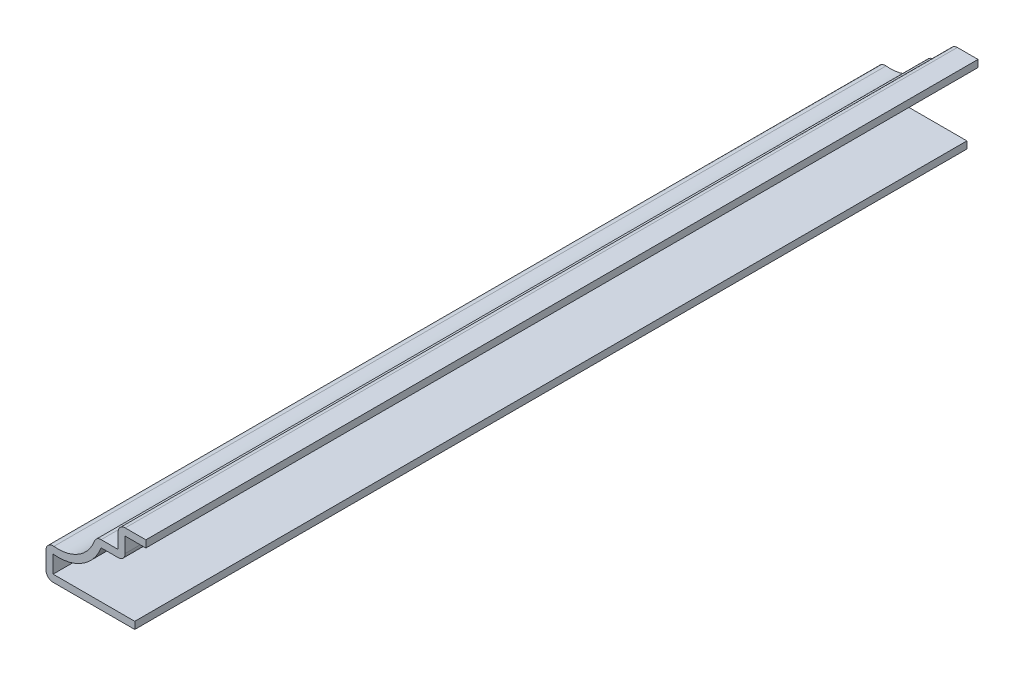
ISO-10303-21;
HEADER;
FILE_DESCRIPTION(('STEP AP214'),'2;1');
FILE_NAME('part.step','',(''),(''),'','','');
FILE_SCHEMA(('AUTOMOTIVE_DESIGN { 1 0 10303 214 1 1 1 1 }'));
ENDSEC;
DATA;
#1=APPLICATION_CONTEXT('core data for automotive mechanical design processes');
#2=APPLICATION_PROTOCOL_DEFINITION('international standard','automotive_design',2000,#1);
#3=PRODUCT_CONTEXT('',#1,'mechanical');
#4=PRODUCT('Part','Part','',(#3));
#5=PRODUCT_RELATED_PRODUCT_CATEGORY('part','',(#4));
#6=PRODUCT_DEFINITION_FORMATION('','',#4);
#7=PRODUCT_DEFINITION_CONTEXT('part definition',#1,'design');
#8=PRODUCT_DEFINITION('design','',#6,#7);
#9=PRODUCT_DEFINITION_SHAPE('','',#8);
#10=(LENGTH_UNIT() NAMED_UNIT(*) SI_UNIT(.MILLI.,.METRE.));
#11=(NAMED_UNIT(*) PLANE_ANGLE_UNIT() SI_UNIT($,.RADIAN.));
#12=(NAMED_UNIT(*) SI_UNIT($,.STERADIAN.) SOLID_ANGLE_UNIT());
#13=UNCERTAINTY_MEASURE_WITH_UNIT(LENGTH_MEASURE(1.E-05),#10,'distance_accuracy_value','');
#14=(GEOMETRIC_REPRESENTATION_CONTEXT(3) GLOBAL_UNCERTAINTY_ASSIGNED_CONTEXT((#13)) GLOBAL_UNIT_ASSIGNED_CONTEXT((#10,
#11,#12)) REPRESENTATION_CONTEXT('',''));
#15=CARTESIAN_POINT('',(0.,0.,0.));
#16=DIRECTION('',(0.,0.,1.));
#17=DIRECTION('',(1.,0.,0.));
#18=AXIS2_PLACEMENT_3D('',#15,#16,#17);
#19=CARTESIAN_POINT('',(-2.38125,10.89025,-119.0625));
#20=DIRECTION('',(0.,-1.,0.));
#21=DIRECTION('',(0.,0.,-1.));
#22=AXIS2_PLACEMENT_3D('',#19,#20,#21);
#23=PLANE('',#22);
#24=DIRECTION('',(1.,0.,0.));
#25=VECTOR('',#24,1.);
#26=CARTESIAN_POINT('',(-2.38125,10.89025,0.));
#27=LINE('',#26,#25);
#28=CARTESIAN_POINT('',(-1.36525,10.89025,0.));
#29=VERTEX_POINT('',#28);
#30=CARTESIAN_POINT('',(1.5875,10.89025,0.));
#31=VERTEX_POINT('',#30);
#32=EDGE_CURVE('E225',#29,#31,#27,.T.);
#33=ORIENTED_EDGE('',*,*,#32,.F.);
#34=DIRECTION('',(0.,0.,1.));
#35=VECTOR('',#34,1.);
#36=CARTESIAN_POINT('',(-1.36525,10.89025,-119.0625));
#37=LINE('',#36,#35);
#38=CARTESIAN_POINT('',(-1.36525,10.89025,-119.0625));
#39=VERTEX_POINT('',#38);
#40=EDGE_CURVE('E190',#39,#29,#37,.T.);
#41=ORIENTED_EDGE('',*,*,#40,.F.);
#42=DIRECTION('',(1.,0.,0.));
#43=VECTOR('',#42,1.);
#44=CARTESIAN_POINT('',(-2.38125,10.89025,-119.0625));
#45=LINE('',#44,#43);
#46=CARTESIAN_POINT('',(1.5875,10.89025,-119.0625));
#47=VERTEX_POINT('',#46);
#48=EDGE_CURVE('E171',#39,#47,#45,.T.);
#49=ORIENTED_EDGE('',*,*,#48,.T.);
#50=DIRECTION('',(0.,0.,1.));
#51=VECTOR('',#50,1.);
#52=CARTESIAN_POINT('',(1.5875,10.89025,-119.0625));
#53=LINE('',#52,#51);
#54=EDGE_CURVE('E178',#47,#31,#53,.T.);
#55=ORIENTED_EDGE('',*,*,#54,.T.);
#56=EDGE_LOOP('',(#33,#41,#49,#55));
#57=FACE_BOUND('',#56,.T.);
#58=ADVANCED_FACE('F35',(#57),#23,.T.);
#59=CARTESIAN_POINT('',(-1.36525,8.73125,-119.0625));
#60=DIRECTION('',(1.,0.,0.));
#61=DIRECTION('',(0.,0.,-1.));
#62=AXIS2_PLACEMENT_3D('',#59,#60,#61);
#63=PLANE('',#62);
#64=DIRECTION('',(0.,1.,0.));
#65=VECTOR('',#64,1.);
#66=CARTESIAN_POINT('',(-1.36525,8.73125,0.));
#67=LINE('',#66,#65);
#68=CARTESIAN_POINT('',(-1.36525,8.73125,0.));
#69=VERTEX_POINT('',#68);
#70=EDGE_CURVE('E191',#69,#29,#67,.T.);
#71=ORIENTED_EDGE('',*,*,#70,.F.);
#72=DIRECTION('',(0.,0.,1.));
#73=VECTOR('',#72,1.);
#74=CARTESIAN_POINT('',(-1.36525,8.73125,-119.0625));
#75=LINE('',#74,#73);
#76=CARTESIAN_POINT('',(-1.36525,8.73125,-119.0625));
#77=VERTEX_POINT('',#76);
#78=EDGE_CURVE('E285',#69,#77,#75,.F.);
#79=ORIENTED_EDGE('',*,*,#78,.T.);
#80=DIRECTION('',(0.,1.,0.));
#81=VECTOR('',#80,1.);
#82=CARTESIAN_POINT('',(-1.36525,8.73125,-119.0625));
#83=LINE('',#82,#81);
#84=EDGE_CURVE('E186',#77,#39,#83,.T.);
#85=ORIENTED_EDGE('',*,*,#84,.T.);
#86=ORIENTED_EDGE('',*,*,#40,.T.);
#87=EDGE_LOOP('',(#71,#79,#85,#86));
#88=FACE_BOUND('',#87,.T.);
#89=ADVANCED_FACE('F347',(#88),#63,.T.);
#90=CARTESIAN_POINT('',(-5.55625,7.71525,-119.0625));
#91=DIRECTION('',(0.,-1.,0.));
#92=DIRECTION('',(0.,0.,-1.));
#93=AXIS2_PLACEMENT_3D('',#90,#91,#92);
#94=PLANE('',#93);
#95=DIRECTION('',(1.,0.,0.));
#96=VECTOR('',#95,1.);
#97=CARTESIAN_POINT('',(-5.55625,7.71525,-119.0625));
#98=LINE('',#97,#96);
#99=CARTESIAN_POINT('',(-4.80855690000142,7.71525,-119.0625));
#100=VERTEX_POINT('',#99);
#101=CARTESIAN_POINT('',(-2.38125,7.71525,-119.0625));
#102=VERTEX_POINT('',#101);
#103=EDGE_CURVE('E221',#100,#102,#98,.T.);
#104=ORIENTED_EDGE('',*,*,#103,.T.);
#105=DIRECTION('',(0.,0.,1.));
#106=VECTOR('',#105,1.);
#107=CARTESIAN_POINT('',(-2.38125,7.71525,-119.0625));
#108=LINE('',#107,#106);
#109=CARTESIAN_POINT('',(-2.38125,7.71525,0.));
#110=VERTEX_POINT('',#109);
#111=EDGE_CURVE('E257',#102,#110,#108,.T.);
#112=ORIENTED_EDGE('',*,*,#111,.T.);
#113=DIRECTION('',(1.,0.,0.));
#114=VECTOR('',#113,1.);
#115=CARTESIAN_POINT('',(-5.55625,7.71525,0.));
#116=LINE('',#115,#114);
#117=CARTESIAN_POINT('',(-4.80855690000142,7.71525,0.));
#118=VERTEX_POINT('',#117);
#119=EDGE_CURVE('E193',#118,#110,#116,.T.);
#120=ORIENTED_EDGE('',*,*,#119,.F.);
#121=DIRECTION('',(0.,0.,1.));
#122=VECTOR('',#121,1.);
#123=CARTESIAN_POINT('',(-4.80855690000142,7.71525,-119.0625));
#124=LINE('',#123,#122);
#125=EDGE_CURVE('E258',#100,#118,#124,.T.);
#126=ORIENTED_EDGE('',*,*,#125,.F.);
#127=EDGE_LOOP('',(#104,#112,#120,#126));
#128=FACE_BOUND('',#127,.T.);
#129=ADVANCED_FACE('F355',(#128),#94,.T.);
#130=CARTESIAN_POINT('',(-10.9566128087011,10.0381530556619,-119.0625));
#131=DIRECTION('',(0.,0.,1.));
#132=DIRECTION('',(1.,0.,0.));
#133=AXIS2_PLACEMENT_3D('',#130,#131,#132);
#134=CYLINDRICAL_SURFACE('',#133,6.57225);
#135=CARTESIAN_POINT('',(-10.9566128087011,10.0381530556619,0.));
#136=DIRECTION('',(0.,0.,1.));
#137=DIRECTION('',(1.,0.,0.));
#138=AXIS2_PLACEMENT_3D('',#135,#136,#137);
#139=CIRCLE('',#138,6.57225);
#140=CARTESIAN_POINT('',(-11.684,3.50627905684394,0.));
#141=VERTEX_POINT('',#140);
#142=EDGE_CURVE('E251',#141,#118,#139,.T.);
#143=ORIENTED_EDGE('',*,*,#142,.F.);
#144=DIRECTION('',(0.,0.,1.));
#145=VECTOR('',#144,1.);
#146=CARTESIAN_POINT('',(-11.684,3.50627905684394,-119.0625));
#147=LINE('',#146,#145);
#148=CARTESIAN_POINT('',(-11.684,3.50627905684394,-119.0625));
#149=VERTEX_POINT('',#148);
#150=EDGE_CURVE('E260',#149,#141,#147,.T.);
#151=ORIENTED_EDGE('',*,*,#150,.F.);
#152=CARTESIAN_POINT('',(-10.9566128087011,10.0381530556619,-119.0625));
#153=DIRECTION('',(0.,0.,1.));
#154=DIRECTION('',(1.,0.,0.));
#155=AXIS2_PLACEMENT_3D('',#152,#153,#154);
#156=CIRCLE('',#155,6.57225);
#157=EDGE_CURVE('E218',#149,#100,#156,.T.);
#158=ORIENTED_EDGE('',*,*,#157,.T.);
#159=ORIENTED_EDGE('',*,*,#125,.T.);
#160=EDGE_LOOP('',(#143,#151,#158,#159));
#161=FACE_BOUND('',#160,.T.);
#162=ADVANCED_FACE('F359',(#161),#134,.T.);
#163=CARTESIAN_POINT('',(-11.684,0.,-119.0625));
#164=DIRECTION('',(1.,0.,0.));
#165=DIRECTION('',(0.,0.,-1.));
#166=AXIS2_PLACEMENT_3D('',#163,#164,#165);
#167=PLANE('',#166);
#168=DIRECTION('',(0.,1.,0.));
#169=VECTOR('',#168,1.);
#170=CARTESIAN_POINT('',(-11.684,0.,0.));
#171=LINE('',#170,#169);
#172=CARTESIAN_POINT('',(-11.684,1.016,0.));
#173=VERTEX_POINT('',#172);
#174=EDGE_CURVE('E248',#173,#141,#171,.T.);
#175=ORIENTED_EDGE('',*,*,#174,.F.);
#176=DIRECTION('',(0.,0.,1.));
#177=VECTOR('',#176,1.);
#178=CARTESIAN_POINT('',(-11.684,1.016,-119.0625));
#179=LINE('',#178,#177);
#180=CARTESIAN_POINT('',(-11.684,1.016,-119.0625));
#181=VERTEX_POINT('',#180);
#182=EDGE_CURVE('E262',#181,#173,#179,.T.);
#183=ORIENTED_EDGE('',*,*,#182,.F.);
#184=DIRECTION('',(0.,1.,0.));
#185=VECTOR('',#184,1.);
#186=CARTESIAN_POINT('',(-11.684,0.,-119.0625));
#187=LINE('',#186,#185);
#188=EDGE_CURVE('E215',#181,#149,#187,.T.);
#189=ORIENTED_EDGE('',*,*,#188,.T.);
#190=ORIENTED_EDGE('',*,*,#150,.T.);
#191=EDGE_LOOP('',(#175,#183,#189,#190));
#192=FACE_BOUND('',#191,.T.);
#193=ADVANCED_FACE('F364',(#192),#167,.T.);
#194=CARTESIAN_POINT('',(0.,1.016,-119.0625));
#195=DIRECTION('',(0.,1.,0.));
#196=DIRECTION('',(0.,0.,1.));
#197=AXIS2_PLACEMENT_3D('',#194,#195,#196);
#198=PLANE('',#197);
#199=DIRECTION('',(1.,0.,0.));
#200=VECTOR('',#199,1.);
#201=CARTESIAN_POINT('',(0.,1.016,0.));
#202=LINE('',#201,#200);
#203=CARTESIAN_POINT('',(0.,1.016,0.));
#204=VERTEX_POINT('',#203);
#205=EDGE_CURVE('E245',#204,#173,#202,.F.);
#206=ORIENTED_EDGE('',*,*,#205,.F.);
#207=DIRECTION('',(0.,0.,1.));
#208=VECTOR('',#207,1.);
#209=CARTESIAN_POINT('',(0.,1.016,-119.0625));
#210=LINE('',#209,#208);
#211=CARTESIAN_POINT('',(0.,1.016,-119.0625));
#212=VERTEX_POINT('',#211);
#213=EDGE_CURVE('E264',#212,#204,#210,.T.);
#214=ORIENTED_EDGE('',*,*,#213,.F.);
#215=DIRECTION('',(1.,0.,0.));
#216=VECTOR('',#215,1.);
#217=CARTESIAN_POINT('',(0.,1.016,-119.0625));
#218=LINE('',#217,#216);
#219=EDGE_CURVE('E212',#212,#181,#218,.F.);
#220=ORIENTED_EDGE('',*,*,#219,.T.);
#221=ORIENTED_EDGE('',*,*,#182,.T.);
#222=EDGE_LOOP('',(#206,#214,#220,#221));
#223=FACE_BOUND('',#222,.T.);
#224=ADVANCED_FACE('F367',(#223),#198,.T.);
#225=CARTESIAN_POINT('',(0.,1.016,-119.0625));
#226=DIRECTION('',(-1.,0.,0.));
#227=DIRECTION('',(0.,0.,1.));
#228=AXIS2_PLACEMENT_3D('',#225,#226,#227);
#229=PLANE('',#228);
#230=DIRECTION('',(0.,-1.,0.));
#231=VECTOR('',#230,1.);
#232=CARTESIAN_POINT('',(0.,1.016,0.));
#233=LINE('',#232,#231);
#234=CARTESIAN_POINT('',(0.,0.,0.));
#235=VERTEX_POINT('',#234);
#236=EDGE_CURVE('E243',#204,#235,#233,.T.);
#237=ORIENTED_EDGE('',*,*,#236,.T.);
#238=DIRECTION('',(0.,0.,1.));
#239=VECTOR('',#238,1.);
#240=CARTESIAN_POINT('',(0.,0.,-119.0625));
#241=LINE('',#240,#239);
#242=CARTESIAN_POINT('',(0.,0.,-119.0625));
#243=VERTEX_POINT('',#242);
#244=EDGE_CURVE('E266',#243,#235,#241,.T.);
#245=ORIENTED_EDGE('',*,*,#244,.F.);
#246=DIRECTION('',(0.,-1.,0.));
#247=VECTOR('',#246,1.);
#248=CARTESIAN_POINT('',(0.,1.016,-119.0625));
#249=LINE('',#248,#247);
#250=EDGE_CURVE('E210',#212,#243,#249,.T.);
#251=ORIENTED_EDGE('',*,*,#250,.F.);
#252=ORIENTED_EDGE('',*,*,#213,.T.);
#253=EDGE_LOOP('',(#237,#245,#251,#252));
#254=FACE_BOUND('',#253,.T.);
#255=ADVANCED_FACE('F372',(#254),#229,.F.);
#256=CARTESIAN_POINT('',(0.,0.,-119.0625));
#257=DIRECTION('',(0.,1.,0.));
#258=DIRECTION('',(0.,0.,1.));
#259=AXIS2_PLACEMENT_3D('',#256,#257,#258);
#260=PLANE('',#259);
#261=DIRECTION('',(-1.,0.,0.));
#262=VECTOR('',#261,1.);
#263=CARTESIAN_POINT('',(0.,0.,0.));
#264=LINE('',#263,#262);
#265=CARTESIAN_POINT('',(-11.684,0.,0.));
#266=VERTEX_POINT('',#265);
#267=EDGE_CURVE('E240',#235,#266,#264,.T.);
#268=ORIENTED_EDGE('',*,*,#267,.T.);
#269=DIRECTION('',(0.,0.,1.));
#270=VECTOR('',#269,1.);
#271=CARTESIAN_POINT('',(-11.684,0.,-119.0625));
#272=LINE('',#271,#270);
#273=CARTESIAN_POINT('',(-11.684,0.,-119.0625));
#274=VERTEX_POINT('',#273);
#275=EDGE_CURVE('E11',#266,#274,#272,.F.);
#276=ORIENTED_EDGE('',*,*,#275,.T.);
#277=DIRECTION('',(-1.,0.,0.));
#278=VECTOR('',#277,1.);
#279=CARTESIAN_POINT('',(0.,0.,-119.0625));
#280=LINE('',#279,#278);
#281=EDGE_CURVE('E207',#243,#274,#280,.T.);
#282=ORIENTED_EDGE('',*,*,#281,.F.);
#283=ORIENTED_EDGE('',*,*,#244,.T.);
#284=EDGE_LOOP('',(#268,#276,#282,#283));
#285=FACE_BOUND('',#284,.T.);
#286=ADVANCED_FACE('F376',(#285),#260,.F.);
#287=CARTESIAN_POINT('',(-12.7,0.,-119.0625));
#288=DIRECTION('',(1.,0.,0.));
#289=DIRECTION('',(0.,0.,-1.));
#290=AXIS2_PLACEMENT_3D('',#287,#288,#289);
#291=PLANE('',#290);
#292=DIRECTION('',(0.,1.,0.));
#293=VECTOR('',#292,1.);
#294=CARTESIAN_POINT('',(-12.7,0.,0.));
#295=LINE('',#294,#293);
#296=CARTESIAN_POINT('',(-12.7,1.016,0.));
#297=VERTEX_POINT('',#296);
#298=CARTESIAN_POINT('',(-12.7,3.50627905684394,0.));
#299=VERTEX_POINT('',#298);
#300=EDGE_CURVE('E237',#297,#299,#295,.T.);
#301=ORIENTED_EDGE('',*,*,#300,.T.);
#302=DIRECTION('',(0.,0.,1.));
#303=VECTOR('',#302,1.);
#304=CARTESIAN_POINT('',(-12.7,3.50627905684394,-119.0625));
#305=LINE('',#304,#303);
#306=CARTESIAN_POINT('',(-12.7,3.50627905684394,-119.0625));
#307=VERTEX_POINT('',#306);
#308=EDGE_CURVE('E43',#299,#307,#305,.F.);
#309=ORIENTED_EDGE('',*,*,#308,.T.);
#310=DIRECTION('',(0.,1.,0.));
#311=VECTOR('',#310,1.);
#312=CARTESIAN_POINT('',(-12.7,0.,-119.0625));
#313=LINE('',#312,#311);
#314=CARTESIAN_POINT('',(-12.7,1.016,-119.0625));
#315=VERTEX_POINT('',#314);
#316=EDGE_CURVE('E204',#315,#307,#313,.T.);
#317=ORIENTED_EDGE('',*,*,#316,.F.);
#318=DIRECTION('',(0.,0.,1.));
#319=VECTOR('',#318,1.);
#320=CARTESIAN_POINT('',(-12.7,1.016,-119.0625));
#321=LINE('',#320,#319);
#322=EDGE_CURVE('E308',#315,#297,#321,.T.);
#323=ORIENTED_EDGE('',*,*,#322,.T.);
#324=EDGE_LOOP('',(#301,#309,#317,#323));
#325=FACE_BOUND('',#324,.T.);
#326=ADVANCED_FACE('F313',(#325),#291,.F.);
#327=CARTESIAN_POINT('',(-10.9566128087011,10.0381530556619,-119.0625));
#328=DIRECTION('',(0.,0.,1.));
#329=DIRECTION('',(1.,0.,0.));
#330=AXIS2_PLACEMENT_3D('',#327,#328,#329);
#331=CYLINDRICAL_SURFACE('',#330,5.55625);
#332=CARTESIAN_POINT('',(-10.9566128087011,10.0381530556619,0.));
#333=DIRECTION('',(0.,0.,1.));
#334=DIRECTION('',(1.,0.,0.));
#335=AXIS2_PLACEMENT_3D('',#332,#333,#334);
#336=CIRCLE('',#335,5.55625);
#337=CARTESIAN_POINT('',(-11.5715536709103,4.51603735617811,0.));
#338=VERTEX_POINT('',#337);
#339=CARTESIAN_POINT('',(-5.75898100182938,8.07434612454677,0.));
#340=VERTEX_POINT('',#339);
#341=EDGE_CURVE('E234',#338,#340,#336,.T.);
#342=ORIENTED_EDGE('',*,*,#341,.T.);
#343=DIRECTION('',(0.,0.,1.));
#344=VECTOR('',#343,1.);
#345=CARTESIAN_POINT('',(-5.75898100182938,8.07434612454677,-119.0625));
#346=LINE('',#345,#344);
#347=CARTESIAN_POINT('',(-5.75898100182938,8.07434612454677,-119.0625));
#348=VERTEX_POINT('',#347);
#349=EDGE_CURVE('E306',#340,#348,#346,.F.);
#350=ORIENTED_EDGE('',*,*,#349,.T.);
#351=CARTESIAN_POINT('',(-10.9566128087011,10.0381530556619,-119.0625));
#352=DIRECTION('',(0.,0.,1.));
#353=DIRECTION('',(1.,0.,0.));
#354=AXIS2_PLACEMENT_3D('',#351,#352,#353);
#355=CIRCLE('',#354,5.55625);
#356=CARTESIAN_POINT('',(-11.5715536709103,4.51603735617811,-119.0625));
#357=VERTEX_POINT('',#356);
#358=EDGE_CURVE('E201',#357,#348,#355,.T.);
#359=ORIENTED_EDGE('',*,*,#358,.F.);
#360=DIRECTION('',(0.,0.,1.));
#361=VECTOR('',#360,1.);
#362=CARTESIAN_POINT('',(-11.5715536709103,4.51603735617811,-119.0625));
#363=LINE('',#362,#361);
#364=EDGE_CURVE('E303',#357,#338,#363,.T.);
#365=ORIENTED_EDGE('',*,*,#364,.T.);
#366=EDGE_LOOP('',(#342,#350,#359,#365));
#367=FACE_BOUND('',#366,.T.);
#368=ADVANCED_FACE('F324',(#367),#331,.F.);
#369=CARTESIAN_POINT('',(-5.55625,8.73125,-119.0625));
#370=DIRECTION('',(0.,-1.,0.));
#371=DIRECTION('',(0.,0.,-1.));
#372=AXIS2_PLACEMENT_3D('',#369,#370,#371);
#373=PLANE('',#372);
#374=DIRECTION('',(1.,0.,0.));
#375=VECTOR('',#374,1.);
#376=CARTESIAN_POINT('',(-5.55625,8.73125,-119.0625));
#377=LINE('',#376,#375);
#378=CARTESIAN_POINT('',(-4.80855690000142,8.73125,-119.0625));
#379=VERTEX_POINT('',#378);
#380=CARTESIAN_POINT('',(-2.38125,8.73125,-119.0625));
#381=VERTEX_POINT('',#380);
#382=EDGE_CURVE('E199',#379,#381,#377,.T.);
#383=ORIENTED_EDGE('',*,*,#382,.F.);
#384=DIRECTION('',(0.,0.,1.));
#385=VECTOR('',#384,1.);
#386=CARTESIAN_POINT('',(-4.80855690000142,8.73125,-119.0625));
#387=LINE('',#386,#385);
#388=CARTESIAN_POINT('',(-4.80855690000142,8.73125,0.));
#389=VERTEX_POINT('',#388);
#390=EDGE_CURVE('E300',#379,#389,#387,.T.);
#391=ORIENTED_EDGE('',*,*,#390,.T.);
#392=DIRECTION('',(1.,0.,0.));
#393=VECTOR('',#392,1.);
#394=CARTESIAN_POINT('',(-5.55625,8.73125,0.));
#395=LINE('',#394,#393);
#396=CARTESIAN_POINT('',(-2.38125,8.73125,0.));
#397=VERTEX_POINT('',#396);
#398=EDGE_CURVE('E232',#389,#397,#395,.T.);
#399=ORIENTED_EDGE('',*,*,#398,.T.);
#400=DIRECTION('',(0.,0.,1.));
#401=VECTOR('',#400,1.);
#402=CARTESIAN_POINT('',(-2.38125,8.73125,-119.0625));
#403=LINE('',#402,#401);
#404=EDGE_CURVE('E269',#381,#397,#403,.T.);
#405=ORIENTED_EDGE('',*,*,#404,.F.);
#406=EDGE_LOOP('',(#383,#391,#399,#405));
#407=FACE_BOUND('',#406,.T.);
#408=ADVANCED_FACE('F336',(#407),#373,.F.);
#409=CARTESIAN_POINT('',(-2.38125,8.73125,-119.0625));
#410=DIRECTION('',(1.,0.,0.));
#411=DIRECTION('',(0.,0.,-1.));
#412=AXIS2_PLACEMENT_3D('',#409,#410,#411);
#413=PLANE('',#412);
#414=DIRECTION('',(0.,1.,0.));
#415=VECTOR('',#414,1.);
#416=CARTESIAN_POINT('',(-2.38125,8.73125,0.));
#417=LINE('',#416,#415);
#418=CARTESIAN_POINT('',(-2.38125,10.89025,0.));
#419=VERTEX_POINT('',#418);
#420=EDGE_CURVE('E230',#397,#419,#417,.T.);
#421=ORIENTED_EDGE('',*,*,#420,.T.);
#422=DIRECTION('',(0.,0.,1.));
#423=VECTOR('',#422,1.);
#424=CARTESIAN_POINT('',(-2.38125,10.89025,-119.0625));
#425=LINE('',#424,#423);
#426=CARTESIAN_POINT('',(-2.38125,10.89025,-119.0625));
#427=VERTEX_POINT('',#426);
#428=EDGE_CURVE('E58',#419,#427,#425,.F.);
#429=ORIENTED_EDGE('',*,*,#428,.T.);
#430=DIRECTION('',(0.,1.,0.));
#431=VECTOR('',#430,1.);
#432=CARTESIAN_POINT('',(-2.38125,8.73125,-119.0625));
#433=LINE('',#432,#431);
#434=EDGE_CURVE('E197',#381,#427,#433,.T.);
#435=ORIENTED_EDGE('',*,*,#434,.F.);
#436=ORIENTED_EDGE('',*,*,#404,.T.);
#437=EDGE_LOOP('',(#421,#429,#435,#436));
#438=FACE_BOUND('',#437,.T.);
#439=ADVANCED_FACE('F453',(#438),#413,.F.);
#440=CARTESIAN_POINT('',(-2.38125,11.90625,-119.0625));
#441=DIRECTION('',(0.,-1.,0.));
#442=DIRECTION('',(0.,0.,-1.));
#443=AXIS2_PLACEMENT_3D('',#440,#441,#442);
#444=PLANE('',#443);
#445=DIRECTION('',(1.,0.,0.));
#446=VECTOR('',#445,1.);
#447=CARTESIAN_POINT('',(-2.38125,11.90625,-119.0625));
#448=LINE('',#447,#446);
#449=CARTESIAN_POINT('',(-1.36525,11.90625,-119.0625));
#450=VERTEX_POINT('',#449);
#451=CARTESIAN_POINT('',(1.5875,11.90625,-119.0625));
#452=VERTEX_POINT('',#451);
#453=EDGE_CURVE('E172',#450,#452,#448,.T.);
#454=ORIENTED_EDGE('',*,*,#453,.F.);
#455=DIRECTION('',(0.,0.,1.));
#456=VECTOR('',#455,1.);
#457=CARTESIAN_POINT('',(-1.36525,11.90625,-119.0625));
#458=LINE('',#457,#456);
#459=CARTESIAN_POINT('',(-1.36525,11.90625,0.));
#460=VERTEX_POINT('',#459);
#461=EDGE_CURVE('E296',#450,#460,#458,.T.);
#462=ORIENTED_EDGE('',*,*,#461,.T.);
#463=DIRECTION('',(1.,0.,0.));
#464=VECTOR('',#463,1.);
#465=CARTESIAN_POINT('',(-2.38125,11.90625,0.));
#466=LINE('',#465,#464);
#467=CARTESIAN_POINT('',(1.5875,11.90625,0.));
#468=VERTEX_POINT('',#467);
#469=EDGE_CURVE('E228',#460,#468,#466,.T.);
#470=ORIENTED_EDGE('',*,*,#469,.T.);
#471=DIRECTION('',(0.,0.,1.));
#472=VECTOR('',#471,1.);
#473=CARTESIAN_POINT('',(1.5875,11.90625,-119.0625));
#474=LINE('',#473,#472);
#475=EDGE_CURVE('E185',#452,#468,#474,.T.);
#476=ORIENTED_EDGE('',*,*,#475,.F.);
#477=EDGE_LOOP('',(#454,#462,#470,#476));
#478=FACE_BOUND('',#477,.T.);
#479=ADVANCED_FACE('F343',(#478),#444,.F.);
#480=CARTESIAN_POINT('',(1.5875,11.90625,-119.0625));
#481=DIRECTION('',(-1.,0.,0.));
#482=DIRECTION('',(0.,0.,1.));
#483=AXIS2_PLACEMENT_3D('',#480,#481,#482);
#484=PLANE('',#483);
#485=DIRECTION('',(0.,-1.,0.));
#486=VECTOR('',#485,1.);
#487=CARTESIAN_POINT('',(1.5875,11.90625,0.));
#488=LINE('',#487,#486);
#489=EDGE_CURVE('E181',#468,#31,#488,.T.);
#490=ORIENTED_EDGE('',*,*,#489,.T.);
#491=ORIENTED_EDGE('',*,*,#54,.F.);
#492=DIRECTION('',(0.,-1.,0.));
#493=VECTOR('',#492,1.);
#494=CARTESIAN_POINT('',(1.5875,11.90625,-119.0625));
#495=LINE('',#494,#493);
#496=EDGE_CURVE('E166',#452,#47,#495,.T.);
#497=ORIENTED_EDGE('',*,*,#496,.F.);
#498=ORIENTED_EDGE('',*,*,#475,.T.);
#499=EDGE_LOOP('',(#490,#491,#497,#498));
#500=FACE_BOUND('',#499,.T.);
#501=ADVANCED_FACE('F179',(#500),#484,.F.);
#502=CARTESIAN_POINT('',(-10.9566128087011,10.0381530556619,-119.0625));
#503=DIRECTION('',(0.,0.,1.));
#504=DIRECTION('',(1.,0.,0.));
#505=AXIS2_PLACEMENT_3D('',#502,#503,#504);
#506=PLANE('',#505);
#507=ORIENTED_EDGE('',*,*,#84,.F.);
#508=CARTESIAN_POINT('',(-2.38125,8.73125,-119.0625));
#509=DIRECTION('',(0.,0.,1.));
#510=DIRECTION('',(1.,0.,0.));
#511=AXIS2_PLACEMENT_3D('',#508,#509,#510);
#512=CIRCLE('',#511,1.016);
#513=EDGE_CURVE('E294',#77,#102,#512,.F.);
#514=ORIENTED_EDGE('',*,*,#513,.T.);
#515=ORIENTED_EDGE('',*,*,#103,.F.);
#516=ORIENTED_EDGE('',*,*,#157,.F.);
#517=ORIENTED_EDGE('',*,*,#188,.F.);
#518=ORIENTED_EDGE('',*,*,#219,.F.);
#519=ORIENTED_EDGE('',*,*,#250,.T.);
#520=ORIENTED_EDGE('',*,*,#281,.T.);
#521=CARTESIAN_POINT('',(-11.684,1.016,-119.0625));
#522=DIRECTION('',(0.,0.,1.));
#523=DIRECTION('',(1.,0.,0.));
#524=AXIS2_PLACEMENT_3D('',#521,#522,#523);
#525=CIRCLE('',#524,1.016);
#526=EDGE_CURVE('E287',#274,#315,#525,.F.);
#527=ORIENTED_EDGE('',*,*,#526,.T.);
#528=ORIENTED_EDGE('',*,*,#316,.T.);
#529=CARTESIAN_POINT('',(-11.684,3.50627905684394,-119.0625));
#530=DIRECTION('',(0.,0.,1.));
#531=DIRECTION('',(1.,0.,0.));
#532=AXIS2_PLACEMENT_3D('',#529,#530,#531);
#533=CIRCLE('',#532,1.016);
#534=EDGE_CURVE('E289',#307,#357,#533,.F.);
#535=ORIENTED_EDGE('',*,*,#534,.T.);
#536=ORIENTED_EDGE('',*,*,#358,.T.);
#537=CARTESIAN_POINT('',(-4.80855690000142,7.71525,-119.0625));
#538=DIRECTION('',(0.,0.,1.));
#539=DIRECTION('',(1.,0.,0.));
#540=AXIS2_PLACEMENT_3D('',#537,#538,#539);
#541=CIRCLE('',#540,1.016);
#542=EDGE_CURVE('E291',#348,#379,#541,.F.);
#543=ORIENTED_EDGE('',*,*,#542,.T.);
#544=ORIENTED_EDGE('',*,*,#382,.T.);
#545=ORIENTED_EDGE('',*,*,#434,.T.);
#546=CARTESIAN_POINT('',(-1.36525,10.89025,-119.0625));
#547=DIRECTION('',(0.,0.,1.));
#548=DIRECTION('',(1.,0.,0.));
#549=AXIS2_PLACEMENT_3D('',#546,#547,#548);
#550=CIRCLE('',#549,1.016);
#551=EDGE_CURVE('E50',#427,#450,#550,.F.);
#552=ORIENTED_EDGE('',*,*,#551,.T.);
#553=ORIENTED_EDGE('',*,*,#453,.T.);
#554=ORIENTED_EDGE('',*,*,#496,.T.);
#555=ORIENTED_EDGE('',*,*,#48,.F.);
#556=EDGE_LOOP('',(#507,#514,#515,#516,#517,#518,#519,#520,#527,#528,#535,#536,#543,#544,#545,
#552,#553,#554,#555));
#557=FACE_BOUND('',#556,.T.);
#558=ADVANCED_FACE('F169',(#557),#506,.F.);
#559=CARTESIAN_POINT('',(-10.9566128087011,10.0381530556619,0.));
#560=DIRECTION('',(0.,0.,1.));
#561=DIRECTION('',(1.,0.,0.));
#562=AXIS2_PLACEMENT_3D('',#559,#560,#561);
#563=PLANE('',#562);
#564=ORIENTED_EDGE('',*,*,#119,.T.);
#565=CARTESIAN_POINT('',(-2.38125,8.73125,0.));
#566=DIRECTION('',(0.,0.,1.));
#567=DIRECTION('',(1.,0.,0.));
#568=AXIS2_PLACEMENT_3D('',#565,#566,#567);
#569=CIRCLE('',#568,1.016);
#570=EDGE_CURVE('E283',#110,#69,#569,.T.);
#571=ORIENTED_EDGE('',*,*,#570,.T.);
#572=ORIENTED_EDGE('',*,*,#70,.T.);
#573=ORIENTED_EDGE('',*,*,#32,.T.);
#574=ORIENTED_EDGE('',*,*,#489,.F.);
#575=ORIENTED_EDGE('',*,*,#469,.F.);
#576=CARTESIAN_POINT('',(-1.36525,10.89025,0.));
#577=DIRECTION('',(0.,0.,1.));
#578=DIRECTION('',(1.,0.,0.));
#579=AXIS2_PLACEMENT_3D('',#576,#577,#578);
#580=CIRCLE('',#579,1.016);
#581=EDGE_CURVE('E281',#460,#419,#580,.T.);
#582=ORIENTED_EDGE('',*,*,#581,.T.);
#583=ORIENTED_EDGE('',*,*,#420,.F.);
#584=ORIENTED_EDGE('',*,*,#398,.F.);
#585=CARTESIAN_POINT('',(-4.80855690000142,7.71525,0.));
#586=DIRECTION('',(0.,0.,1.));
#587=DIRECTION('',(1.,0.,0.));
#588=AXIS2_PLACEMENT_3D('',#585,#586,#587);
#589=CIRCLE('',#588,1.016);
#590=EDGE_CURVE('E279',#389,#340,#589,.T.);
#591=ORIENTED_EDGE('',*,*,#590,.T.);
#592=ORIENTED_EDGE('',*,*,#341,.F.);
#593=CARTESIAN_POINT('',(-11.684,3.50627905684394,0.));
#594=DIRECTION('',(0.,0.,1.));
#595=DIRECTION('',(1.,0.,0.));
#596=AXIS2_PLACEMENT_3D('',#593,#594,#595);
#597=CIRCLE('',#596,1.016);
#598=EDGE_CURVE('E277',#338,#299,#597,.T.);
#599=ORIENTED_EDGE('',*,*,#598,.T.);
#600=ORIENTED_EDGE('',*,*,#300,.F.);
#601=CARTESIAN_POINT('',(-11.684,1.016,0.));
#602=DIRECTION('',(0.,0.,1.));
#603=DIRECTION('',(1.,0.,0.));
#604=AXIS2_PLACEMENT_3D('',#601,#602,#603);
#605=CIRCLE('',#604,1.016);
#606=EDGE_CURVE('E275',#297,#266,#605,.T.);
#607=ORIENTED_EDGE('',*,*,#606,.T.);
#608=ORIENTED_EDGE('',*,*,#267,.F.);
#609=ORIENTED_EDGE('',*,*,#236,.F.);
#610=ORIENTED_EDGE('',*,*,#205,.T.);
#611=ORIENTED_EDGE('',*,*,#174,.T.);
#612=ORIENTED_EDGE('',*,*,#142,.T.);
#613=EDGE_LOOP('',(#564,#571,#572,#573,#574,#575,#582,#583,#584,#591,#592,#599,#600,#607,#608,
#609,#610,#611,#612));
#614=FACE_BOUND('',#613,.T.);
#615=ADVANCED_FACE('F327',(#614),#563,.T.);
#616=CARTESIAN_POINT('',(-2.38125,8.73125,-119.0625));
#617=DIRECTION('',(0.,0.,1.));
#618=DIRECTION('',(1.,0.,0.));
#619=AXIS2_PLACEMENT_3D('',#616,#617,#618);
#620=CYLINDRICAL_SURFACE('',#619,1.016);
#621=ORIENTED_EDGE('',*,*,#513,.F.);
#622=ORIENTED_EDGE('',*,*,#78,.F.);
#623=ORIENTED_EDGE('',*,*,#570,.F.);
#624=ORIENTED_EDGE('',*,*,#111,.F.);
#625=EDGE_LOOP('',(#621,#622,#623,#624));
#626=FACE_BOUND('',#625,.T.);
#627=ADVANCED_FACE('F352',(#626),#620,.T.);
#628=CARTESIAN_POINT('',(-1.36525,10.89025,-119.0625));
#629=DIRECTION('',(0.,0.,1.));
#630=DIRECTION('',(1.,0.,0.));
#631=AXIS2_PLACEMENT_3D('',#628,#629,#630);
#632=CYLINDRICAL_SURFACE('',#631,1.016);
#633=ORIENTED_EDGE('',*,*,#551,.F.);
#634=ORIENTED_EDGE('',*,*,#428,.F.);
#635=ORIENTED_EDGE('',*,*,#581,.F.);
#636=ORIENTED_EDGE('',*,*,#461,.F.);
#637=EDGE_LOOP('',(#633,#634,#635,#636));
#638=FACE_BOUND('',#637,.T.);
#639=ADVANCED_FACE('F340',(#638),#632,.T.);
#640=CARTESIAN_POINT('',(-4.80855690000142,7.71525,-119.0625));
#641=DIRECTION('',(0.,0.,1.));
#642=DIRECTION('',(1.,0.,0.));
#643=AXIS2_PLACEMENT_3D('',#640,#641,#642);
#644=CYLINDRICAL_SURFACE('',#643,1.016);
#645=ORIENTED_EDGE('',*,*,#542,.F.);
#646=ORIENTED_EDGE('',*,*,#349,.F.);
#647=ORIENTED_EDGE('',*,*,#590,.F.);
#648=ORIENTED_EDGE('',*,*,#390,.F.);
#649=EDGE_LOOP('',(#645,#646,#647,#648));
#650=FACE_BOUND('',#649,.T.);
#651=ADVANCED_FACE('F333',(#650),#644,.T.);
#652=CARTESIAN_POINT('',(-11.684,3.50627905684394,-119.0625));
#653=DIRECTION('',(0.,0.,1.));
#654=DIRECTION('',(1.,0.,0.));
#655=AXIS2_PLACEMENT_3D('',#652,#653,#654);
#656=CYLINDRICAL_SURFACE('',#655,1.016);
#657=ORIENTED_EDGE('',*,*,#534,.F.);
#658=ORIENTED_EDGE('',*,*,#308,.F.);
#659=ORIENTED_EDGE('',*,*,#598,.F.);
#660=ORIENTED_EDGE('',*,*,#364,.F.);
#661=EDGE_LOOP('',(#657,#658,#659,#660));
#662=FACE_BOUND('',#661,.T.);
#663=ADVANCED_FACE('F321',(#662),#656,.T.);
#664=CARTESIAN_POINT('',(-11.684,1.016,-119.0625));
#665=DIRECTION('',(0.,0.,1.));
#666=DIRECTION('',(1.,0.,0.));
#667=AXIS2_PLACEMENT_3D('',#664,#665,#666);
#668=CYLINDRICAL_SURFACE('',#667,1.016);
#669=ORIENTED_EDGE('',*,*,#526,.F.);
#670=ORIENTED_EDGE('',*,*,#275,.F.);
#671=ORIENTED_EDGE('',*,*,#606,.F.);
#672=ORIENTED_EDGE('',*,*,#322,.F.);
#673=EDGE_LOOP('',(#669,#670,#671,#672));
#674=FACE_BOUND('',#673,.T.);
#675=ADVANCED_FACE('F37',(#674),#668,.T.);
#676=CLOSED_SHELL('',(#58,#89,#129,#162,#193,#224,#255,#286,#326,#368,#408,#439,#479,#501,#558,
#615,#627,#639,#651,#663,#675));
#677=MANIFOLD_SOLID_BREP('B2',#676);
#678=ADVANCED_BREP_SHAPE_REPRESENTATION('',(#18,#677),#14);
#679=SHAPE_DEFINITION_REPRESENTATION(#9,#678);
ENDSEC;
END-ISO-10303-21;
